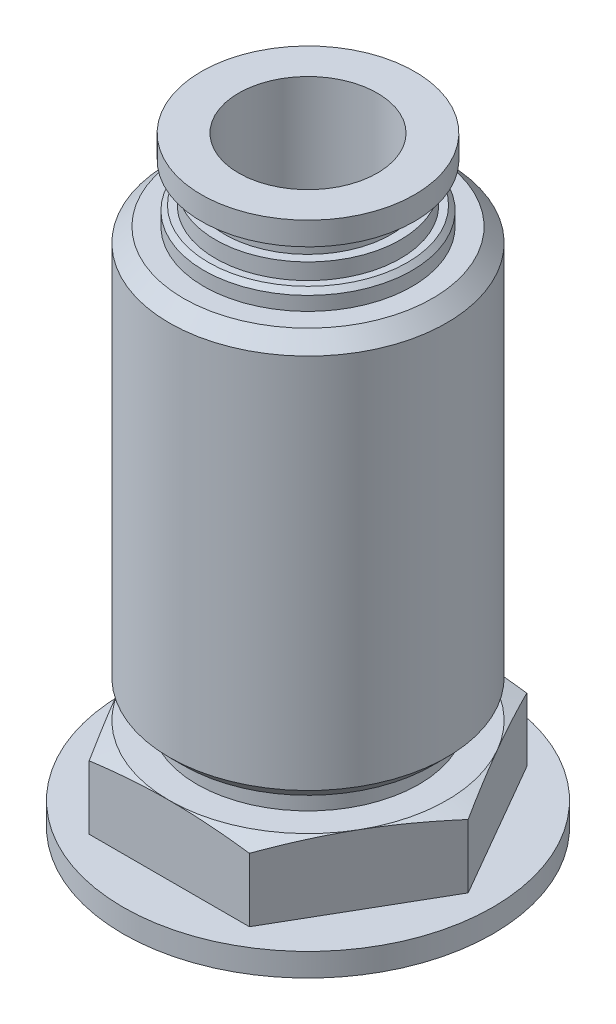
ISO-10303-21;
HEADER;
FILE_DESCRIPTION(('STEP AP214'),'2;1');
FILE_NAME('part.step','',(''),(''),'','','');
FILE_SCHEMA(('AUTOMOTIVE_DESIGN { 1 0 10303 214 1 1 1 1 }'));
ENDSEC;
DATA;
#1=APPLICATION_CONTEXT('core data for automotive mechanical design processes');
#2=APPLICATION_PROTOCOL_DEFINITION('international standard','automotive_design',2000,#1);
#3=PRODUCT_CONTEXT('',#1,'mechanical');
#4=PRODUCT('Part','Part','',(#3));
#5=PRODUCT_RELATED_PRODUCT_CATEGORY('part','',(#4));
#6=PRODUCT_DEFINITION_FORMATION('','',#4);
#7=PRODUCT_DEFINITION_CONTEXT('part definition',#1,'design');
#8=PRODUCT_DEFINITION('design','',#6,#7);
#9=PRODUCT_DEFINITION_SHAPE('','',#8);
#10=(LENGTH_UNIT() NAMED_UNIT(*) SI_UNIT(.MILLI.,.METRE.));
#11=(NAMED_UNIT(*) PLANE_ANGLE_UNIT() SI_UNIT($,.RADIAN.));
#12=(NAMED_UNIT(*) SI_UNIT($,.STERADIAN.) SOLID_ANGLE_UNIT());
#13=UNCERTAINTY_MEASURE_WITH_UNIT(LENGTH_MEASURE(1.E-05),#10,'distance_accuracy_value','');
#14=(GEOMETRIC_REPRESENTATION_CONTEXT(3) GLOBAL_UNCERTAINTY_ASSIGNED_CONTEXT((#13)) GLOBAL_UNIT_ASSIGNED_CONTEXT((#10,
#11,#12)) REPRESENTATION_CONTEXT('',''));
#15=CARTESIAN_POINT('',(0.,0.,0.));
#16=DIRECTION('',(0.,0.,1.));
#17=DIRECTION('',(1.,0.,0.));
#18=AXIS2_PLACEMENT_3D('',#15,#16,#17);
#19=CARTESIAN_POINT('',(5.3865,13.,0.));
#20=DIRECTION('',(0.,1.,0.));
#21=DIRECTION('',(0.,0.,1.));
#22=AXIS2_PLACEMENT_3D('',#19,#20,#21);
#23=PLANE('',#22);
#24=CARTESIAN_POINT('',(0.,13.,0.));
#25=DIRECTION('',(0.,1.,0.));
#26=DIRECTION('',(0.,0.,1.));
#27=AXIS2_PLACEMENT_3D('',#24,#25,#26);
#28=CIRCLE('',#27,5.3865);
#29=CARTESIAN_POINT('',(0.,13.,5.3865));
#30=VERTEX_POINT('',#29);
#31=EDGE_CURVE('E176',#30,#30,#28,.T.);
#32=ORIENTED_EDGE('',*,*,#31,.F.);
#33=EDGE_LOOP('',(#32));
#34=FACE_BOUND('',#33,.T.);
#35=CARTESIAN_POINT('',(0.,13.,0.));
#36=DIRECTION('',(0.,1.,0.));
#37=DIRECTION('',(0.,0.,1.));
#38=AXIS2_PLACEMENT_3D('',#35,#36,#37);
#39=CIRCLE('',#38,4.8);
#40=CARTESIAN_POINT('',(0.,13.,4.8));
#41=VERTEX_POINT('',#40);
#42=EDGE_CURVE('E11',#41,#41,#39,.F.);
#43=ORIENTED_EDGE('',*,*,#42,.F.);
#44=EDGE_LOOP('',(#43));
#45=FACE_BOUND('',#44,.T.);
#46=ADVANCED_FACE('F39',(#34,#45),#23,.F.);
#47=CARTESIAN_POINT('',(0.,34.,0.));
#48=DIRECTION('',(0.,-1.,0.));
#49=DIRECTION('',(1.,0.,0.));
#50=AXIS2_PLACEMENT_3D('',#47,#48,#49);
#51=PLANE('',#50);
#52=CARTESIAN_POINT('',(0.,34.,0.));
#53=DIRECTION('',(0.,1.,0.));
#54=DIRECTION('',(-1.,0.,0.));
#55=AXIS2_PLACEMENT_3D('',#52,#53,#54);
#56=CIRCLE('',#55,4.6153846153846);
#57=CARTESIAN_POINT('',(-4.6153846153846,34.,0.));
#58=VERTEX_POINT('',#57);
#59=EDGE_CURVE('E200',#58,#58,#56,.T.);
#60=ORIENTED_EDGE('',*,*,#59,.T.);
#61=EDGE_LOOP('',(#60));
#62=FACE_BOUND('',#61,.T.);
#63=CARTESIAN_POINT('',(0.,34.,0.));
#64=DIRECTION('',(0.,1.,0.));
#65=DIRECTION('',(0.,0.,1.));
#66=AXIS2_PLACEMENT_3D('',#63,#64,#65);
#67=CIRCLE('',#66,3.);
#68=CARTESIAN_POINT('',(0.,34.,3.));
#69=VERTEX_POINT('',#68);
#70=EDGE_CURVE('E133',#69,#69,#67,.T.);
#71=ORIENTED_EDGE('',*,*,#70,.F.);
#72=EDGE_LOOP('',(#71));
#73=FACE_BOUND('',#72,.T.);
#74=ADVANCED_FACE('F41',(#62,#73),#51,.F.);
#75=CARTESIAN_POINT('',(0.,30.5,0.));
#76=DIRECTION('',(0.,-1.,0.));
#77=DIRECTION('',(0.,0.,-1.));
#78=AXIS2_PLACEMENT_3D('',#75,#76,#77);
#79=PLANE('',#78);
#80=CARTESIAN_POINT('',(0.,30.5,0.));
#81=DIRECTION('',(0.,1.,0.));
#82=DIRECTION('',(0.,0.,1.));
#83=AXIS2_PLACEMENT_3D('',#80,#81,#82);
#84=CIRCLE('',#83,5.3865);
#85=CARTESIAN_POINT('',(0.,30.5,5.3865));
#86=VERTEX_POINT('',#85);
#87=EDGE_CURVE('E185',#86,#86,#84,.T.);
#88=ORIENTED_EDGE('',*,*,#87,.T.);
#89=EDGE_LOOP('',(#88));
#90=FACE_BOUND('',#89,.T.);
#91=CARTESIAN_POINT('',(0.,30.5,0.));
#92=DIRECTION('',(0.,-1.,0.));
#93=DIRECTION('',(0.,0.,-1.));
#94=AXIS2_PLACEMENT_3D('',#91,#92,#93);
#95=CIRCLE('',#94,4.5);
#96=CARTESIAN_POINT('',(0.,30.5,-4.5));
#97=VERTEX_POINT('',#96);
#98=EDGE_CURVE('E203',#97,#97,#95,.F.);
#99=ORIENTED_EDGE('',*,*,#98,.F.);
#100=EDGE_LOOP('',(#99));
#101=FACE_BOUND('',#100,.T.);
#102=ADVANCED_FACE('F279',(#90,#101),#79,.F.);
#103=CARTESIAN_POINT('',(0.,29.8865,0.));
#104=DIRECTION('',(0.,-1.,0.));
#105=DIRECTION('',(0.,0.,-1.));
#106=AXIS2_PLACEMENT_3D('',#103,#104,#105);
#107=CONICAL_SURFACE('',#106,6.,0.785398163397446);
#108=ORIENTED_EDGE('',*,*,#87,.F.);
#109=EDGE_LOOP('',(#108));
#110=FACE_BOUND('',#109,.T.);
#111=CARTESIAN_POINT('',(0.,29.8865,0.));
#112=DIRECTION('',(0.,1.,0.));
#113=DIRECTION('',(0.,0.,1.));
#114=AXIS2_PLACEMENT_3D('',#111,#112,#113);
#115=CIRCLE('',#114,6.);
#116=CARTESIAN_POINT('',(0.,29.8865,6.));
#117=VERTEX_POINT('',#116);
#118=EDGE_CURVE('E182',#117,#117,#115,.T.);
#119=ORIENTED_EDGE('',*,*,#118,.T.);
#120=EDGE_LOOP('',(#119));
#121=FACE_BOUND('',#120,.T.);
#122=ADVANCED_FACE('F294',(#110,#121),#107,.T.);
#123=CARTESIAN_POINT('',(0.,13.,0.));
#124=DIRECTION('',(0.,1.,0.));
#125=DIRECTION('',(0.,0.,1.));
#126=AXIS2_PLACEMENT_3D('',#123,#124,#125);
#127=CYLINDRICAL_SURFACE('',#126,6.);
#128=ORIENTED_EDGE('',*,*,#118,.F.);
#129=EDGE_LOOP('',(#128));
#130=FACE_BOUND('',#129,.T.);
#131=CARTESIAN_POINT('',(0.,13.6135,0.));
#132=DIRECTION('',(0.,1.,0.));
#133=DIRECTION('',(0.,0.,1.));
#134=AXIS2_PLACEMENT_3D('',#131,#132,#133);
#135=CIRCLE('',#134,6.);
#136=CARTESIAN_POINT('',(0.,13.6135,6.));
#137=VERTEX_POINT('',#136);
#138=EDGE_CURVE('E179',#137,#137,#135,.T.);
#139=ORIENTED_EDGE('',*,*,#138,.T.);
#140=EDGE_LOOP('',(#139));
#141=FACE_BOUND('',#140,.T.);
#142=ADVANCED_FACE('F290',(#130,#141),#127,.T.);
#143=CARTESIAN_POINT('',(0.,13.,0.));
#144=DIRECTION('',(0.,1.,0.));
#145=DIRECTION('',(0.,0.,1.));
#146=AXIS2_PLACEMENT_3D('',#143,#144,#145);
#147=CONICAL_SURFACE('',#146,5.3865,0.785398163397448);
#148=ORIENTED_EDGE('',*,*,#138,.F.);
#149=EDGE_LOOP('',(#148));
#150=FACE_BOUND('',#149,.T.);
#151=ORIENTED_EDGE('',*,*,#31,.T.);
#152=EDGE_LOOP('',(#151));
#153=FACE_BOUND('',#152,.T.);
#154=ADVANCED_FACE('F287',(#150,#153),#147,.T.);
#155=CARTESIAN_POINT('',(4.,31.3,0.));
#156=DIRECTION('',(0.,-1.,0.));
#157=DIRECTION('',(0.,0.,-1.));
#158=AXIS2_PLACEMENT_3D('',#155,#156,#157);
#159=PLANE('',#158);
#160=CARTESIAN_POINT('',(0.,31.3,0.));
#161=DIRECTION('',(0.,-1.,0.));
#162=DIRECTION('',(0.,0.,-1.));
#163=AXIS2_PLACEMENT_3D('',#160,#161,#162);
#164=CIRCLE('',#163,4.);
#165=CARTESIAN_POINT('',(0.,31.3,-4.));
#166=VERTEX_POINT('',#165);
#167=EDGE_CURVE('E206',#166,#166,#164,.T.);
#168=ORIENTED_EDGE('',*,*,#167,.T.);
#169=EDGE_LOOP('',(#168));
#170=FACE_BOUND('',#169,.T.);
#171=CARTESIAN_POINT('',(0.,31.3,0.));
#172=DIRECTION('',(0.,1.,0.));
#173=DIRECTION('',(0.,0.,1.));
#174=AXIS2_PLACEMENT_3D('',#171,#172,#173);
#175=CIRCLE('',#174,4.3);
#176=CARTESIAN_POINT('',(0.,31.3,4.3));
#177=VERTEX_POINT('',#176);
#178=EDGE_CURVE('E173',#177,#177,#175,.T.);
#179=ORIENTED_EDGE('',*,*,#178,.T.);
#180=EDGE_LOOP('',(#179));
#181=FACE_BOUND('',#180,.T.);
#182=ADVANCED_FACE('F285',(#170,#181),#159,.F.);
#183=CARTESIAN_POINT('',(0.,31.1,0.));
#184=DIRECTION('',(0.,-1.,0.));
#185=DIRECTION('',(0.,0.,-1.));
#186=AXIS2_PLACEMENT_3D('',#183,#184,#185);
#187=CONICAL_SURFACE('',#186,4.5,0.785398163397442);
#188=ORIENTED_EDGE('',*,*,#178,.F.);
#189=EDGE_LOOP('',(#188));
#190=FACE_BOUND('',#189,.T.);
#191=CARTESIAN_POINT('',(0.,31.1,0.));
#192=DIRECTION('',(0.,1.,0.));
#193=DIRECTION('',(0.,0.,1.));
#194=AXIS2_PLACEMENT_3D('',#191,#192,#193);
#195=CIRCLE('',#194,4.5);
#196=CARTESIAN_POINT('',(0.,31.1,4.5));
#197=VERTEX_POINT('',#196);
#198=EDGE_CURVE('E169',#197,#197,#195,.T.);
#199=ORIENTED_EDGE('',*,*,#198,.T.);
#200=EDGE_LOOP('',(#199));
#201=FACE_BOUND('',#200,.T.);
#202=ADVANCED_FACE('F509',(#190,#201),#187,.T.);
#203=CARTESIAN_POINT('',(0.,30.5,0.));
#204=DIRECTION('',(0.,1.,0.));
#205=DIRECTION('',(0.,0.,1.));
#206=AXIS2_PLACEMENT_3D('',#203,#204,#205);
#207=CYLINDRICAL_SURFACE('',#206,4.5);
#208=ORIENTED_EDGE('',*,*,#198,.F.);
#209=EDGE_LOOP('',(#208));
#210=FACE_BOUND('',#209,.T.);
#211=ORIENTED_EDGE('',*,*,#98,.T.);
#212=EDGE_LOOP('',(#211));
#213=FACE_BOUND('',#212,.T.);
#214=ADVANCED_FACE('F423',(#210,#213),#207,.T.);
#215=CARTESIAN_POINT('',(0.,8.,0.));
#216=DIRECTION('',(0.,1.,0.));
#217=DIRECTION('',(-1.,0.,0.));
#218=AXIS2_PLACEMENT_3D('',#215,#216,#217);
#219=CYLINDRICAL_SURFACE('',#218,4.6153846153846);
#220=ORIENTED_EDGE('',*,*,#59,.F.);
#221=EDGE_LOOP('',(#220));
#222=FACE_BOUND('',#221,.T.);
#223=CARTESIAN_POINT('',(0.,33.,0.));
#224=DIRECTION('',(0.,1.,0.));
#225=DIRECTION('',(-1.,0.,0.));
#226=AXIS2_PLACEMENT_3D('',#223,#224,#225);
#227=CIRCLE('',#226,4.6153846153846);
#228=CARTESIAN_POINT('',(-4.6153846153846,33.,0.));
#229=VERTEX_POINT('',#228);
#230=EDGE_CURVE('E197',#229,#229,#227,.T.);
#231=ORIENTED_EDGE('',*,*,#230,.T.);
#232=EDGE_LOOP('',(#231));
#233=FACE_BOUND('',#232,.T.);
#234=ADVANCED_FACE('F518',(#222,#233),#219,.T.);
#235=CARTESIAN_POINT('',(4.6153846153846,33.,0.));
#236=DIRECTION('',(0.,1.,0.));
#237=DIRECTION('',(-1.,0.,0.));
#238=AXIS2_PLACEMENT_3D('',#235,#236,#237);
#239=PLANE('',#238);
#240=ORIENTED_EDGE('',*,*,#230,.F.);
#241=EDGE_LOOP('',(#240));
#242=FACE_BOUND('',#241,.T.);
#243=CARTESIAN_POINT('',(0.,33.,0.));
#244=DIRECTION('',(0.,1.,0.));
#245=DIRECTION('',(-1.,0.,0.));
#246=AXIS2_PLACEMENT_3D('',#243,#244,#245);
#247=CIRCLE('',#246,3.6);
#248=CARTESIAN_POINT('',(-3.6,33.,0.));
#249=VERTEX_POINT('',#248);
#250=EDGE_CURVE('E194',#249,#249,#247,.T.);
#251=ORIENTED_EDGE('',*,*,#250,.T.);
#252=EDGE_LOOP('',(#251));
#253=FACE_BOUND('',#252,.T.);
#254=ADVANCED_FACE('F521',(#242,#253),#239,.F.);
#255=CARTESIAN_POINT('',(0.,8.,0.));
#256=DIRECTION('',(0.,1.,0.));
#257=DIRECTION('',(-1.,0.,0.));
#258=AXIS2_PLACEMENT_3D('',#255,#256,#257);
#259=CYLINDRICAL_SURFACE('',#258,3.6);
#260=ORIENTED_EDGE('',*,*,#250,.F.);
#261=EDGE_LOOP('',(#260));
#262=FACE_BOUND('',#261,.T.);
#263=CARTESIAN_POINT('',(0.,32.,0.));
#264=DIRECTION('',(0.,1.,0.));
#265=DIRECTION('',(-1.,0.,0.));
#266=AXIS2_PLACEMENT_3D('',#263,#264,#265);
#267=CIRCLE('',#266,3.6);
#268=CARTESIAN_POINT('',(-3.6,32.,0.));
#269=VERTEX_POINT('',#268);
#270=EDGE_CURVE('E191',#269,#269,#267,.T.);
#271=ORIENTED_EDGE('',*,*,#270,.T.);
#272=EDGE_LOOP('',(#271));
#273=FACE_BOUND('',#272,.T.);
#274=ADVANCED_FACE('F531',(#262,#273),#259,.T.);
#275=CARTESIAN_POINT('',(3.6,32.,0.));
#276=DIRECTION('',(0.,-1.,0.));
#277=DIRECTION('',(1.,0.,0.));
#278=AXIS2_PLACEMENT_3D('',#275,#276,#277);
#279=PLANE('',#278);
#280=ORIENTED_EDGE('',*,*,#270,.F.);
#281=EDGE_LOOP('',(#280));
#282=FACE_BOUND('',#281,.T.);
#283=CARTESIAN_POINT('',(0.,32.,0.));
#284=DIRECTION('',(0.,1.,0.));
#285=DIRECTION('',(-1.,0.,0.));
#286=AXIS2_PLACEMENT_3D('',#283,#284,#285);
#287=CIRCLE('',#286,4.);
#288=CARTESIAN_POINT('',(-4.,32.,0.));
#289=VERTEX_POINT('',#288);
#290=EDGE_CURVE('E188',#289,#289,#287,.T.);
#291=ORIENTED_EDGE('',*,*,#290,.T.);
#292=EDGE_LOOP('',(#291));
#293=FACE_BOUND('',#292,.T.);
#294=ADVANCED_FACE('F480',(#282,#293),#279,.F.);
#295=CARTESIAN_POINT('',(0.,8.,0.));
#296=DIRECTION('',(0.,1.,0.));
#297=DIRECTION('',(-1.,0.,0.));
#298=AXIS2_PLACEMENT_3D('',#295,#296,#297);
#299=CYLINDRICAL_SURFACE('',#298,4.);
#300=ORIENTED_EDGE('',*,*,#290,.F.);
#301=EDGE_LOOP('',(#300));
#302=FACE_BOUND('',#301,.T.);
#303=ORIENTED_EDGE('',*,*,#167,.F.);
#304=EDGE_LOOP('',(#303));
#305=FACE_BOUND('',#304,.T.);
#306=ADVANCED_FACE('F321',(#302,#305),#299,.T.);
#307=CARTESIAN_POINT('',(0.,22.3,0.));
#308=DIRECTION('',(0.,1.,0.));
#309=DIRECTION('',(0.,0.,1.));
#310=AXIS2_PLACEMENT_3D('',#307,#308,#309);
#311=CYLINDRICAL_SURFACE('',#310,3.);
#312=ORIENTED_EDGE('',*,*,#70,.T.);
#313=EDGE_LOOP('',(#312));
#314=FACE_BOUND('',#313,.T.);
#315=CARTESIAN_POINT('',(0.,22.3,0.));
#316=DIRECTION('',(0.,1.,0.));
#317=DIRECTION('',(0.,0.,1.));
#318=AXIS2_PLACEMENT_3D('',#315,#316,#317);
#319=CIRCLE('',#318,3.);
#320=CARTESIAN_POINT('',(0.,22.3,3.));
#321=VERTEX_POINT('',#320);
#322=EDGE_CURVE('E136',#321,#321,#319,.T.);
#323=ORIENTED_EDGE('',*,*,#322,.F.);
#324=EDGE_LOOP('',(#323));
#325=FACE_BOUND('',#324,.T.);
#326=ADVANCED_FACE('F316',(#314,#325),#311,.F.);
#327=CARTESIAN_POINT('',(3.,22.3,0.));
#328=DIRECTION('',(0.,1.,0.));
#329=DIRECTION('',(0.,0.,1.));
#330=AXIS2_PLACEMENT_3D('',#327,#328,#329);
#331=PLANE('',#330);
#332=ORIENTED_EDGE('',*,*,#322,.T.);
#333=EDGE_LOOP('',(#332));
#334=FACE_BOUND('',#333,.T.);
#335=ADVANCED_FACE('F309',(#334),#331,.T.);
#336=CARTESIAN_POINT('',(0.,12.,0.));
#337=DIRECTION('',(0.,1.,0.));
#338=DIRECTION('',(0.,0.,1.));
#339=AXIS2_PLACEMENT_3D('',#336,#337,#338);
#340=CYLINDRICAL_SURFACE('',#339,4.8);
#341=ORIENTED_EDGE('',*,*,#42,.T.);
#342=EDGE_LOOP('',(#341));
#343=FACE_BOUND('',#342,.T.);
#344=CARTESIAN_POINT('',(0.,12.,0.));
#345=DIRECTION('',(0.,-1.,0.));
#346=DIRECTION('',(1.,0.,0.));
#347=AXIS2_PLACEMENT_3D('',#344,#345,#346);
#348=CIRCLE('',#347,4.8);
#349=CARTESIAN_POINT('',(4.8,12.,0.));
#350=VERTEX_POINT('',#349);
#351=EDGE_CURVE('E47',#350,#350,#348,.F.);
#352=ORIENTED_EDGE('',*,*,#351,.T.);
#353=EDGE_LOOP('',(#352));
#354=FACE_BOUND('',#353,.T.);
#355=ADVANCED_FACE('F256',(#343,#354),#340,.T.);
#356=CARTESIAN_POINT('',(3.1578947368421,8.,0.));
#357=DIRECTION('',(0.,1.,0.));
#358=DIRECTION('',(-1.,0.,0.));
#359=AXIS2_PLACEMENT_3D('',#356,#357,#358);
#360=PLANE('',#359);
#361=CARTESIAN_POINT('',(0.,8.,0.));
#362=DIRECTION('',(0.,1.,0.));
#363=DIRECTION('',(0.,0.,1.));
#364=AXIS2_PLACEMENT_3D('',#361,#362,#363);
#365=CIRCLE('',#364,8.);
#366=CARTESIAN_POINT('',(0.,8.,8.));
#367=VERTEX_POINT('',#366);
#368=EDGE_CURVE('E149',#367,#367,#365,.T.);
#369=ORIENTED_EDGE('',*,*,#368,.F.);
#370=EDGE_LOOP('',(#369));
#371=FACE_BOUND('',#370,.T.);
#372=ADVANCED_FACE('F301',(#371),#360,.F.);
#373=CARTESIAN_POINT('',(0.,8.,0.));
#374=DIRECTION('',(0.,1.,0.));
#375=DIRECTION('',(0.,0.,1.));
#376=AXIS2_PLACEMENT_3D('',#373,#374,#375);
#377=CYLINDRICAL_SURFACE('',#376,8.);
#378=CARTESIAN_POINT('',(0.,9.,0.));
#379=DIRECTION('',(0.,1.,0.));
#380=DIRECTION('',(0.,0.,1.));
#381=AXIS2_PLACEMENT_3D('',#378,#379,#380);
#382=CIRCLE('',#381,8.);
#383=CARTESIAN_POINT('',(0.,9.,8.));
#384=VERTEX_POINT('',#383);
#385=EDGE_CURVE('E162',#384,#384,#382,.T.);
#386=ORIENTED_EDGE('',*,*,#385,.F.);
#387=EDGE_LOOP('',(#386));
#388=FACE_BOUND('',#387,.T.);
#389=ORIENTED_EDGE('',*,*,#368,.T.);
#390=EDGE_LOOP('',(#389));
#391=FACE_BOUND('',#390,.T.);
#392=ADVANCED_FACE('F237',(#388,#391),#377,.T.);
#393=CARTESIAN_POINT('',(7.2,9.,0.));
#394=DIRECTION('',(0.,-1.,0.));
#395=DIRECTION('',(0.,0.,-1.));
#396=AXIS2_PLACEMENT_3D('',#393,#394,#395);
#397=PLANE('',#396);
#398=ORIENTED_EDGE('',*,*,#385,.T.);
#399=EDGE_LOOP('',(#398));
#400=FACE_BOUND('',#399,.T.);
#401=DIRECTION('',(-1.,0.,0.));
#402=VECTOR('',#401,1.);
#403=CARTESIAN_POINT('',(3.4641016151378,9.,-6.));
#404=LINE('',#403,#402);
#405=CARTESIAN_POINT('',(3.4641016151378,9.,-6.));
#406=VERTEX_POINT('',#405);
#407=CARTESIAN_POINT('',(-3.4641016151378,9.,-6.));
#408=VERTEX_POINT('',#407);
#409=EDGE_CURVE('E117',#406,#408,#404,.T.);
#410=ORIENTED_EDGE('',*,*,#409,.F.);
#411=DIRECTION('',(-0.499999999999994,0.,-0.866025403784442));
#412=VECTOR('',#411,1.);
#413=CARTESIAN_POINT('',(6.9282032302755,9.,0.));
#414=LINE('',#413,#412);
#415=CARTESIAN_POINT('',(6.9282032302755,9.,0.));
#416=VERTEX_POINT('',#415);
#417=EDGE_CURVE('E144',#416,#406,#414,.T.);
#418=ORIENTED_EDGE('',*,*,#417,.F.);
#419=DIRECTION('',(0.499999999999994,0.,-0.866025403784442));
#420=VECTOR('',#419,1.);
#421=CARTESIAN_POINT('',(3.4641016151378,9.,6.));
#422=LINE('',#421,#420);
#423=CARTESIAN_POINT('',(3.4641016151378,9.,6.));
#424=VERTEX_POINT('',#423);
#425=EDGE_CURVE('E141',#424,#416,#422,.T.);
#426=ORIENTED_EDGE('',*,*,#425,.F.);
#427=DIRECTION('',(1.,0.,0.));
#428=VECTOR('',#427,1.);
#429=CARTESIAN_POINT('',(-3.4641016151378,9.,6.));
#430=LINE('',#429,#428);
#431=CARTESIAN_POINT('',(-3.4641016151378,9.,6.));
#432=VERTEX_POINT('',#431);
#433=EDGE_CURVE('E127',#432,#424,#430,.T.);
#434=ORIENTED_EDGE('',*,*,#433,.F.);
#435=DIRECTION('',(0.499999999999994,0.,0.866025403784442));
#436=VECTOR('',#435,1.);
#437=CARTESIAN_POINT('',(-6.9282032302755,9.,0.));
#438=LINE('',#437,#436);
#439=CARTESIAN_POINT('',(-6.9282032302755,9.,0.));
#440=VERTEX_POINT('',#439);
#441=EDGE_CURVE('E113',#440,#432,#438,.T.);
#442=ORIENTED_EDGE('',*,*,#441,.F.);
#443=DIRECTION('',(-0.499999999999994,0.,0.866025403784442));
#444=VECTOR('',#443,1.);
#445=CARTESIAN_POINT('',(-3.4641016151378,9.,-6.));
#446=LINE('',#445,#444);
#447=EDGE_CURVE('E123',#408,#440,#446,.T.);
#448=ORIENTED_EDGE('',*,*,#447,.F.);
#449=EDGE_LOOP('',(#410,#418,#426,#434,#442,#448));
#450=FACE_BOUND('',#449,.T.);
#451=ADVANCED_FACE('F122',(#400,#450),#397,.F.);
#452=CARTESIAN_POINT('',(-6.9282032302755,9.,0.));
#453=DIRECTION('',(-0.866025403784442,0.,0.499999999999994));
#454=DIRECTION('',(0.499999999999994,0.,0.866025403784442));
#455=AXIS2_PLACEMENT_3D('',#452,#453,#454);
#456=PLANE('',#455);
#457=CARTESIAN_POINT('',(-3.46398614508396,11.7512577531548,6.0002));
#458=CARTESIAN_POINT('',(-3.60785114953801,11.7898227766866,5.75101850285446));
#459=CARTESIAN_POINT('',(-3.75197700039371,11.8248334749827,5.5013852064883));
#460=CARTESIAN_POINT('',(-4.04073770144574,11.8863440142673,5.00123700103696));
#461=CARTESIAN_POINT('',(-4.1853727343495,11.9128403981973,4.75072177549324));
#462=CARTESIAN_POINT('',(-4.47427486270241,11.9557754458708,4.25032861077121));
#463=CARTESIAN_POINT('',(-4.6185400045307,11.9722653122634,4.00045405536348));
#464=CARTESIAN_POINT('',(-4.90725426581544,11.9943765378923,3.5003862859486));
#465=CARTESIAN_POINT('',(-5.05170334426104,12.,3.2501931429743));
#466=CARTESIAN_POINT('',(-5.34060150115226,12.,2.7498068570257));
#467=CARTESIAN_POINT('',(-5.48505057959786,11.9943765378923,2.49961371405141));
#468=CARTESIAN_POINT('',(-5.7737648408826,11.9722653122634,1.99954594463652));
#469=CARTESIAN_POINT('',(-5.91802998271089,11.9557754458708,1.74967138922879));
#470=CARTESIAN_POINT('',(-6.2069321110638,11.9128403981974,1.24927822450676));
#471=CARTESIAN_POINT('',(-6.35156714396756,11.8863440142673,0.998762998963044));
#472=CARTESIAN_POINT('',(-6.64032784501959,11.8248334749827,0.498614793511703));
#473=CARTESIAN_POINT('',(-6.78445369587529,11.7898227766866,0.248981497145543));
#474=CARTESIAN_POINT('',(-6.92831870032934,11.7512577531548,-0.00020000000000002));
#475=B_SPLINE_CURVE_WITH_KNOTS('',3,(#457,#458,#459,#460,#461,#462,#463,#464,#465,#466,#467,
#468,#469,#470,#471,#472,#473,#474),.UNSPECIFIED.,.F.,.F.,(4,2,2,2,2,2,2,2,4),(0.,
0.87095456724898,1.74226232176158,2.60907321145345,3.47571633871004,4.34235946596663,
5.20917035565849,6.0804781101711,6.95143267742008),.UNSPECIFIED.);
#476=CARTESIAN_POINT('',(-3.4641016151378,11.751288694036,6.));
#477=VERTEX_POINT('',#476);
#478=CARTESIAN_POINT('',(-5.19615242270667,12.,2.99999999999997));
#479=VERTEX_POINT('',#478);
#480=EDGE_CURVE('E54',#477,#479,#475,.T.);
#481=ORIENTED_EDGE('',*,*,#480,.T.);
#482=CARTESIAN_POINT('',(-6.9282032302755,11.751288694036,0.));
#483=VERTEX_POINT('',#482);
#484=EDGE_CURVE('E114',#479,#483,#475,.T.);
#485=ORIENTED_EDGE('',*,*,#484,.T.);
#486=DIRECTION('',(0.,1.,0.));
#487=VECTOR('',#486,1.);
#488=CARTESIAN_POINT('',(-6.9282032302755,9.,0.));
#489=LINE('',#488,#487);
#490=EDGE_CURVE('E110',#440,#483,#489,.T.);
#491=ORIENTED_EDGE('',*,*,#490,.F.);
#492=ORIENTED_EDGE('',*,*,#441,.T.);
#493=DIRECTION('',(0.,1.,0.));
#494=VECTOR('',#493,1.);
#495=CARTESIAN_POINT('',(-3.4641016151378,9.,6.));
#496=LINE('',#495,#494);
#497=EDGE_CURVE('E116',#432,#477,#496,.T.);
#498=ORIENTED_EDGE('',*,*,#497,.T.);
#499=EDGE_LOOP('',(#481,#485,#491,#492,#498));
#500=FACE_BOUND('',#499,.T.);
#501=ADVANCED_FACE('F112',(#500),#456,.T.);
#502=CARTESIAN_POINT('',(-3.4641016151378,9.,-6.));
#503=DIRECTION('',(-0.866025403784442,0.,-0.499999999999994));
#504=DIRECTION('',(-0.499999999999994,0.,0.866025403784442));
#505=AXIS2_PLACEMENT_3D('',#502,#503,#504);
#506=PLANE('',#505);
#507=CARTESIAN_POINT('',(-6.92831870032934,11.7512577531548,0.000200000000000273));
#508=CARTESIAN_POINT('',(-6.78445369587529,11.7898227766866,-0.248981497145544));
#509=CARTESIAN_POINT('',(-6.64032784501959,11.8248334749827,-0.498614793511703));
#510=CARTESIAN_POINT('',(-6.35156714396756,11.8863440142673,-0.998762998963043));
#511=CARTESIAN_POINT('',(-6.2069321110638,11.9128403981974,-1.24927822450676));
#512=CARTESIAN_POINT('',(-5.91802998271089,11.9557754458708,-1.74967138922879));
#513=CARTESIAN_POINT('',(-5.7737648408826,11.9722653122634,-1.99954594463652));
#514=CARTESIAN_POINT('',(-5.48505057959786,11.9943765378923,-2.49961371405141));
#515=CARTESIAN_POINT('',(-5.34060150115226,12.,-2.7498068570257));
#516=CARTESIAN_POINT('',(-5.05170334426104,12.,-3.2501931429743));
#517=CARTESIAN_POINT('',(-4.90725426581544,11.9943765378923,-3.5003862859486));
#518=CARTESIAN_POINT('',(-4.6185400045307,11.9722653122634,-4.00045405536348));
#519=CARTESIAN_POINT('',(-4.47427486270241,11.9557754458708,-4.25032861077121));
#520=CARTESIAN_POINT('',(-4.1853727343495,11.9128403981973,-4.75072177549324));
#521=CARTESIAN_POINT('',(-4.04073770144574,11.8863440142673,-5.00123700103696));
#522=CARTESIAN_POINT('',(-3.75197700039371,11.8248334749827,-5.5013852064883));
#523=CARTESIAN_POINT('',(-3.60785114953801,11.7898227766866,-5.75101850285446));
#524=CARTESIAN_POINT('',(-3.46398614508396,11.7512577531548,-6.0002));
#525=B_SPLINE_CURVE_WITH_KNOTS('',3,(#507,#508,#509,#510,#511,#512,#513,#514,#515,#516,#517,
#518,#519,#520,#521,#522,#523,#524),.UNSPECIFIED.,.F.,.F.,(4,2,2,2,2,2,2,2,4),(0.,
0.870954567248979,1.74226232176158,2.60907321145345,3.47571633871004,4.34235946596663,
5.20917035565849,6.08047811017109,6.95143267742008),.UNSPECIFIED.);
#526=CARTESIAN_POINT('',(-5.19615242270667,12.,-2.99999999999997));
#527=VERTEX_POINT('',#526);
#528=EDGE_CURVE('E62',#483,#527,#525,.T.);
#529=ORIENTED_EDGE('',*,*,#528,.T.);
#530=CARTESIAN_POINT('',(-3.4641016151378,11.751288694036,-6.));
#531=VERTEX_POINT('',#530);
#532=EDGE_CURVE('E239',#527,#531,#525,.T.);
#533=ORIENTED_EDGE('',*,*,#532,.T.);
#534=DIRECTION('',(0.,1.,0.));
#535=VECTOR('',#534,1.);
#536=CARTESIAN_POINT('',(-3.4641016151378,9.,-6.));
#537=LINE('',#536,#535);
#538=EDGE_CURVE('E132',#408,#531,#537,.T.);
#539=ORIENTED_EDGE('',*,*,#538,.F.);
#540=ORIENTED_EDGE('',*,*,#447,.T.);
#541=ORIENTED_EDGE('',*,*,#490,.T.);
#542=EDGE_LOOP('',(#529,#533,#539,#540,#541));
#543=FACE_BOUND('',#542,.T.);
#544=ADVANCED_FACE('F130',(#543),#506,.T.);
#545=CARTESIAN_POINT('',(3.4641016151378,9.,-6.));
#546=DIRECTION('',(0.,0.,-1.));
#547=DIRECTION('',(-1.,0.,0.));
#548=AXIS2_PLACEMENT_3D('',#545,#546,#547);
#549=PLANE('',#548);
#550=CARTESIAN_POINT('',(-9.16382765485783,10.6727555670348,-6.));
#551=CARTESIAN_POINT('',(-8.89162489863269,10.733759588259,-6.));
#552=CARTESIAN_POINT('',(-8.61925188813901,10.7940175275095,-6.));
#553=CARTESIAN_POINT('',(-8.07408174438072,10.9126385252989,-6.));
#554=CARTESIAN_POINT('',(-7.80128459333043,10.9710015019998,-6.));
#555=CARTESIAN_POINT('',(-7.25493818445117,11.0854806473668,-6.));
#556=CARTESIAN_POINT('',(-6.98138845134595,11.1415945558695,-6.));
#557=CARTESIAN_POINT('',(-6.43371961760336,11.2509698760187,-6.));
#558=CARTESIAN_POINT('',(-6.15960052179164,11.3042313117397,-6.));
#559=CARTESIAN_POINT('',(-5.61288009287953,11.4068119519654,-6.));
#560=CARTESIAN_POINT('',(-5.34028403864809,11.4561591528044,-6.));
#561=CARTESIAN_POINT('',(-4.7943483713761,11.5505453002354,-6.));
#562=CARTESIAN_POINT('',(-4.52100877483286,11.5955843416254,-6.));
#563=CARTESIAN_POINT('',(-3.97353296098104,11.6803400730214,-6.));
#564=CARTESIAN_POINT('',(-3.69939684599487,11.7200574182413,-6.));
#565=CARTESIAN_POINT('',(-3.15025226081739,11.7929993521357,-6.));
#566=CARTESIAN_POINT('',(-2.87524378980905,11.8262239347275,-6.));
#567=CARTESIAN_POINT('',(-2.32125188635544,11.8852395423477,-6.));
#568=CARTESIAN_POINT('',(-2.0422588391531,11.9109416510582,-6.));
#569=CARTESIAN_POINT('',(-1.48357135195331,11.9531392361281,-6.));
#570=CARTESIAN_POINT('',(-1.20387692818903,11.9696349236277,-6.));
#571=CARTESIAN_POINT('',(-0.644192410317616,11.9924575712443,-6.));
#572=CARTESIAN_POINT('',(-0.36420250851933,11.998789152412,-6.));
#573=CARTESIAN_POINT('',(0.195817560334687,12.0008943092124,-6.));
#574=CARTESIAN_POINT('',(0.4758477273555,11.9966678939464,-6.));
#575=CARTESIAN_POINT('',(1.03657385560212,11.9778947367831,-6.));
#576=CARTESIAN_POINT('',(1.31726853715422,11.9633105383406,-6.));
#577=CARTESIAN_POINT('',(1.87799777180817,11.9246543031433,-6.));
#578=CARTESIAN_POINT('',(2.15803231015705,11.9005820563328,-6.));
#579=CARTESIAN_POINT('',(2.71743890307923,11.8441656885802,-6.));
#580=CARTESIAN_POINT('',(2.99681040476791,11.81181616937,-6.));
#581=CARTESIAN_POINT('',(3.55465431831763,11.7401913404367,-6.));
#582=CARTESIAN_POINT('',(3.83312672735307,11.7009160089691,-6.));
#583=CARTESIAN_POINT('',(4.37079108357547,11.6194842772285,-6.));
#584=CARTESIAN_POINT('',(4.63003857626493,11.5776909241219,-6.));
#585=CARTESIAN_POINT('',(5.14785025731751,11.4900474584768,-6.));
#586=CARTESIAN_POINT('',(5.40641442683975,11.444197235258,-6.));
#587=CARTESIAN_POINT('',(5.92295406743762,11.3491822400412,-6.));
#588=CARTESIAN_POINT('',(6.18092948361034,11.3000171710125,-6.));
#589=CARTESIAN_POINT('',(6.69635047199391,11.1989776154861,-6.));
#590=CARTESIAN_POINT('',(6.95379603729497,11.1471030938841,-6.));
#591=CARTESIAN_POINT('',(7.72556579429413,10.9881514393349,-6.));
#592=CARTESIAN_POINT('',(8.23920828092254,10.8777678111909,-6.));
#593=CARTESIAN_POINT('',(9.26512727645668,10.6510249493938,-6.));
#594=CARTESIAN_POINT('',(9.77740386342661,10.5346660652892,-6.));
#595=CARTESIAN_POINT('',(10.795950885197,10.2989027885365,-6.));
#596=CARTESIAN_POINT('',(11.3022308741471,10.179539557974,-6.));
#597=CARTESIAN_POINT('',(12.3140845458194,9.9378247836334,-6.));
#598=CARTESIAN_POINT('',(12.8196582154967,9.81547318541511,-6.));
#599=CARTESIAN_POINT('',(13.8296414737607,9.56871438982767,-6.));
#600=CARTESIAN_POINT('',(14.3340517289558,9.44430991544821,-6.));
#601=CARTESIAN_POINT('',(15.342432866452,9.19380225109001,-6.));
#602=CARTESIAN_POINT('',(15.8464037627037,9.06769911730612,-6.));
#603=CARTESIAN_POINT('',(16.3502215277059,8.94099441628253,-6.));
#604=B_SPLINE_CURVE_WITH_KNOTS('',3,(#550,#551,#552,#553,#554,#555,#556,#557,#558,#559,#560,
#561,#562,#563,#564,#565,#566,#567,#568,#569,#570,#571,#572,#573,#574,#575,#576,#577,#578,#579,
#580,#581,#582,#583,#584,#585,#586,#587,#588,#589,#590,#591,#592,#593,#594,#595,#596,#597,#598,
#599,#600,#601,#602,#603),.UNSPECIFIED.,.F.,.F.,(4,2,2,2,2,2,2,2,2,2,2,2,2,2,2,2,2,2,2,2,2,2,2,
2,2,2,4),(0.,0.836868078359521,1.67377225067133,2.51149738287136,3.34921544366766,
4.18026773125687,5.01130172790701,5.84223331240184,6.67316567535613,7.51355604767867,
8.35392714568046,9.19391606561573,10.0339042614476,10.8769456513052,11.7200057062844,
12.5636169955068,13.407230933402,14.194976895706,14.9827443560883,15.770582499348,
16.5584308525189,18.1344778451384,19.7104327448356,21.2709015916152,22.8313988872358,
24.3899704837216,25.9484906457265),.UNSPECIFIED.);
#605=CARTESIAN_POINT('',(0.,12.,-6.));
#606=VERTEX_POINT('',#605);
#607=EDGE_CURVE('E245',#531,#606,#604,.T.);
#608=ORIENTED_EDGE('',*,*,#607,.T.);
#609=CARTESIAN_POINT('',(3.4641016151378,11.751288694036,-6.));
#610=VERTEX_POINT('',#609);
#611=EDGE_CURVE('E246',#606,#610,#604,.T.);
#612=ORIENTED_EDGE('',*,*,#611,.T.);
#613=DIRECTION('',(0.,1.,0.));
#614=VECTOR('',#613,1.);
#615=CARTESIAN_POINT('',(3.4641016151378,9.,-6.));
#616=LINE('',#615,#614);
#617=EDGE_CURVE('E150',#406,#610,#616,.T.);
#618=ORIENTED_EDGE('',*,*,#617,.F.);
#619=ORIENTED_EDGE('',*,*,#409,.T.);
#620=ORIENTED_EDGE('',*,*,#538,.T.);
#621=EDGE_LOOP('',(#608,#612,#618,#619,#620));
#622=FACE_BOUND('',#621,.T.);
#623=ADVANCED_FACE('F236',(#622),#549,.T.);
#624=CARTESIAN_POINT('',(6.9282032302755,9.,0.));
#625=DIRECTION('',(0.866025403784442,0.,-0.499999999999994));
#626=DIRECTION('',(-0.499999999999994,0.,-0.866025403784442));
#627=AXIS2_PLACEMENT_3D('',#624,#625,#626);
#628=PLANE('',#627);
#629=CARTESIAN_POINT('',(3.46398614508396,11.7512577531548,-6.0002));
#630=CARTESIAN_POINT('',(3.60785114953801,11.7898227766866,-5.75101850285446));
#631=CARTESIAN_POINT('',(3.75197700039371,11.8248334749827,-5.5013852064883));
#632=CARTESIAN_POINT('',(4.04073770144574,11.8863440142673,-5.00123700103696));
#633=CARTESIAN_POINT('',(4.1853727343495,11.9128403981973,-4.75072177549324));
#634=CARTESIAN_POINT('',(4.47427486270241,11.9557754458708,-4.25032861077121));
#635=CARTESIAN_POINT('',(4.6185400045307,11.9722653122634,-4.00045405536348));
#636=CARTESIAN_POINT('',(4.90725426581544,11.9943765378923,-3.5003862859486));
#637=CARTESIAN_POINT('',(5.05170334426104,12.,-3.2501931429743));
#638=CARTESIAN_POINT('',(5.34060150115226,12.,-2.7498068570257));
#639=CARTESIAN_POINT('',(5.48505057959786,11.9943765378923,-2.49961371405141));
#640=CARTESIAN_POINT('',(5.7737648408826,11.9722653122634,-1.99954594463652));
#641=CARTESIAN_POINT('',(5.91802998271089,11.9557754458708,-1.74967138922879));
#642=CARTESIAN_POINT('',(6.2069321110638,11.9128403981974,-1.24927822450676));
#643=CARTESIAN_POINT('',(6.35156714396756,11.8863440142673,-0.998762998963044));
#644=CARTESIAN_POINT('',(6.64032784501959,11.8248334749827,-0.498614793511703));
#645=CARTESIAN_POINT('',(6.78445369587529,11.7898227766866,-0.248981497145543));
#646=CARTESIAN_POINT('',(6.92831870032934,11.7512577531548,0.00020000000000002));
#647=B_SPLINE_CURVE_WITH_KNOTS('',3,(#629,#630,#631,#632,#633,#634,#635,#636,#637,#638,#639,
#640,#641,#642,#643,#644,#645,#646),.UNSPECIFIED.,.F.,.F.,(4,2,2,2,2,2,2,2,4),(0.,
0.87095456724898,1.74226232176158,2.60907321145345,3.47571633871004,4.34235946596663,
5.20917035565849,6.0804781101711,6.95143267742008),.UNSPECIFIED.);
#648=CARTESIAN_POINT('',(5.19615242270667,12.,-2.99999999999997));
#649=VERTEX_POINT('',#648);
#650=EDGE_CURVE('E338',#610,#649,#647,.T.);
#651=ORIENTED_EDGE('',*,*,#650,.T.);
#652=CARTESIAN_POINT('',(6.9282032302755,11.751288694036,0.));
#653=VERTEX_POINT('',#652);
#654=EDGE_CURVE('E333',#649,#653,#647,.T.);
#655=ORIENTED_EDGE('',*,*,#654,.T.);
#656=DIRECTION('',(0.,1.,0.));
#657=VECTOR('',#656,1.);
#658=CARTESIAN_POINT('',(6.9282032302755,9.,0.));
#659=LINE('',#658,#657);
#660=EDGE_CURVE('E153',#416,#653,#659,.T.);
#661=ORIENTED_EDGE('',*,*,#660,.F.);
#662=ORIENTED_EDGE('',*,*,#417,.T.);
#663=ORIENTED_EDGE('',*,*,#617,.T.);
#664=EDGE_LOOP('',(#651,#655,#661,#662,#663));
#665=FACE_BOUND('',#664,.T.);
#666=ADVANCED_FACE('F326',(#665),#628,.T.);
#667=CARTESIAN_POINT('',(-3.4641016151378,9.,6.));
#668=DIRECTION('',(0.,0.,1.));
#669=DIRECTION('',(1.,0.,0.));
#670=AXIS2_PLACEMENT_3D('',#667,#668,#669);
#671=PLANE('',#670);
#672=CARTESIAN_POINT('',(-9.16382765485783,10.6727555670348,6.));
#673=CARTESIAN_POINT('',(-8.89162489863269,10.733759588259,6.));
#674=CARTESIAN_POINT('',(-8.61925188813901,10.7940175275095,6.));
#675=CARTESIAN_POINT('',(-8.07408174438072,10.9126385252989,6.));
#676=CARTESIAN_POINT('',(-7.80128459333043,10.9710015019998,6.));
#677=CARTESIAN_POINT('',(-7.25493818445117,11.0854806473668,6.));
#678=CARTESIAN_POINT('',(-6.98138845134595,11.1415945558695,6.));
#679=CARTESIAN_POINT('',(-6.43371961760336,11.2509698760187,6.));
#680=CARTESIAN_POINT('',(-6.15960052179164,11.3042313117397,6.));
#681=CARTESIAN_POINT('',(-5.61288009287953,11.4068119519654,6.));
#682=CARTESIAN_POINT('',(-5.34028403864809,11.4561591528044,6.));
#683=CARTESIAN_POINT('',(-4.7943483713761,11.5505453002354,6.));
#684=CARTESIAN_POINT('',(-4.52100877483286,11.5955843416254,6.));
#685=CARTESIAN_POINT('',(-3.97353296098104,11.6803400730214,6.));
#686=CARTESIAN_POINT('',(-3.69939684599487,11.7200574182413,6.));
#687=CARTESIAN_POINT('',(-3.15025226081739,11.7929993521357,6.));
#688=CARTESIAN_POINT('',(-2.87524378980905,11.8262239347275,6.));
#689=CARTESIAN_POINT('',(-2.32125188635544,11.8852395423477,6.));
#690=CARTESIAN_POINT('',(-2.0422588391531,11.9109416510582,6.));
#691=CARTESIAN_POINT('',(-1.48357135195331,11.9531392361281,6.));
#692=CARTESIAN_POINT('',(-1.20387692818903,11.9696349236277,6.));
#693=CARTESIAN_POINT('',(-0.644192410317616,11.9924575712443,6.));
#694=CARTESIAN_POINT('',(-0.36420250851933,11.998789152412,6.));
#695=CARTESIAN_POINT('',(0.195817560334687,12.0008943092124,6.));
#696=CARTESIAN_POINT('',(0.4758477273555,11.9966678939464,6.));
#697=CARTESIAN_POINT('',(1.03657385560212,11.9778947367831,6.));
#698=CARTESIAN_POINT('',(1.31726853715422,11.9633105383406,6.));
#699=CARTESIAN_POINT('',(1.87799777180817,11.9246543031433,6.));
#700=CARTESIAN_POINT('',(2.15803231015705,11.9005820563328,6.));
#701=CARTESIAN_POINT('',(2.71743890307923,11.8441656885802,6.));
#702=CARTESIAN_POINT('',(2.99681040476791,11.81181616937,6.));
#703=CARTESIAN_POINT('',(3.55465431831763,11.7401913404367,6.));
#704=CARTESIAN_POINT('',(3.83312672735307,11.7009160089691,6.));
#705=CARTESIAN_POINT('',(4.37079108357547,11.6194842772285,6.));
#706=CARTESIAN_POINT('',(4.63003857626493,11.5776909241219,6.));
#707=CARTESIAN_POINT('',(5.14785025731751,11.4900474584768,6.));
#708=CARTESIAN_POINT('',(5.40641442683975,11.444197235258,6.));
#709=CARTESIAN_POINT('',(5.92295406743762,11.3491822400412,6.));
#710=CARTESIAN_POINT('',(6.18092948361034,11.3000171710125,6.));
#711=CARTESIAN_POINT('',(6.69635047199391,11.1989776154861,6.));
#712=CARTESIAN_POINT('',(6.95379603729497,11.1471030938841,6.));
#713=CARTESIAN_POINT('',(7.72556579429413,10.9881514393349,6.));
#714=CARTESIAN_POINT('',(8.23920828092254,10.8777678111909,6.));
#715=CARTESIAN_POINT('',(9.26512727645668,10.6510249493938,6.));
#716=CARTESIAN_POINT('',(9.77740386342661,10.5346660652892,6.));
#717=CARTESIAN_POINT('',(10.795950885197,10.2989027885365,6.));
#718=CARTESIAN_POINT('',(11.3022308741471,10.179539557974,6.));
#719=CARTESIAN_POINT('',(12.3140845458194,9.9378247836334,6.));
#720=CARTESIAN_POINT('',(12.8196582154967,9.81547318541511,6.));
#721=CARTESIAN_POINT('',(13.8296414737607,9.56871438982767,6.));
#722=CARTESIAN_POINT('',(14.3340517289558,9.44430991544821,6.));
#723=CARTESIAN_POINT('',(15.342432866452,9.19380225109001,6.));
#724=CARTESIAN_POINT('',(15.8464037627037,9.06769911730612,6.));
#725=CARTESIAN_POINT('',(16.3502215277059,8.94099441628253,6.));
#726=B_SPLINE_CURVE_WITH_KNOTS('',3,(#672,#673,#674,#675,#676,#677,#678,#679,#680,#681,#682,
#683,#684,#685,#686,#687,#688,#689,#690,#691,#692,#693,#694,#695,#696,#697,#698,#699,#700,#701,
#702,#703,#704,#705,#706,#707,#708,#709,#710,#711,#712,#713,#714,#715,#716,#717,#718,#719,#720,
#721,#722,#723,#724,#725),.UNSPECIFIED.,.F.,.F.,(4,2,2,2,2,2,2,2,2,2,2,2,2,2,2,2,2,2,2,2,2,2,2,
2,2,2,4),(0.,0.836868078359521,1.67377225067133,2.51149738287136,3.34921544366766,
4.18026773125687,5.01130172790701,5.84223331240184,6.67316567535613,7.51355604767867,
8.35392714568046,9.19391606561573,10.0339042614476,10.8769456513052,11.7200057062844,
12.5636169955068,13.407230933402,14.194976895706,14.9827443560883,15.770582499348,
16.5584308525189,18.1344778451384,19.7104327448356,21.2709015916152,22.8313988872358,
24.3899704837216,25.9484906457265),.UNSPECIFIED.);
#727=CARTESIAN_POINT('',(3.4641016151378,11.751288694036,6.));
#728=VERTEX_POINT('',#727);
#729=CARTESIAN_POINT('',(0.,12.,6.));
#730=VERTEX_POINT('',#729);
#731=EDGE_CURVE('E345',#728,#730,#726,.F.);
#732=ORIENTED_EDGE('',*,*,#731,.T.);
#733=EDGE_CURVE('E216',#730,#477,#726,.F.);
#734=ORIENTED_EDGE('',*,*,#733,.T.);
#735=ORIENTED_EDGE('',*,*,#497,.F.);
#736=ORIENTED_EDGE('',*,*,#433,.T.);
#737=DIRECTION('',(0.,1.,0.));
#738=VECTOR('',#737,1.);
#739=CARTESIAN_POINT('',(3.4641016151378,9.,6.));
#740=LINE('',#739,#738);
#741=EDGE_CURVE('E156',#424,#728,#740,.T.);
#742=ORIENTED_EDGE('',*,*,#741,.T.);
#743=EDGE_LOOP('',(#732,#734,#735,#736,#742));
#744=FACE_BOUND('',#743,.T.);
#745=ADVANCED_FACE('F230',(#744),#671,.T.);
#746=CARTESIAN_POINT('',(3.4641016151378,9.,6.));
#747=DIRECTION('',(0.866025403784442,0.,0.499999999999994));
#748=DIRECTION('',(0.499999999999994,0.,-0.866025403784442));
#749=AXIS2_PLACEMENT_3D('',#746,#747,#748);
#750=PLANE('',#749);
#751=CARTESIAN_POINT('',(6.92831870032934,11.7512577531548,-0.000200000000000273));
#752=CARTESIAN_POINT('',(6.78445369587529,11.7898227766866,0.248981497145544));
#753=CARTESIAN_POINT('',(6.64032784501959,11.8248334749827,0.498614793511703));
#754=CARTESIAN_POINT('',(6.35156714396756,11.8863440142673,0.998762998963043));
#755=CARTESIAN_POINT('',(6.2069321110638,11.9128403981974,1.24927822450676));
#756=CARTESIAN_POINT('',(5.91802998271089,11.9557754458708,1.74967138922879));
#757=CARTESIAN_POINT('',(5.7737648408826,11.9722653122634,1.99954594463652));
#758=CARTESIAN_POINT('',(5.48505057959786,11.9943765378923,2.49961371405141));
#759=CARTESIAN_POINT('',(5.34060150115226,12.,2.7498068570257));
#760=CARTESIAN_POINT('',(5.05170334426104,12.,3.2501931429743));
#761=CARTESIAN_POINT('',(4.90725426581544,11.9943765378923,3.5003862859486));
#762=CARTESIAN_POINT('',(4.6185400045307,11.9722653122634,4.00045405536348));
#763=CARTESIAN_POINT('',(4.47427486270241,11.9557754458708,4.25032861077121));
#764=CARTESIAN_POINT('',(4.1853727343495,11.9128403981973,4.75072177549324));
#765=CARTESIAN_POINT('',(4.04073770144574,11.8863440142673,5.00123700103696));
#766=CARTESIAN_POINT('',(3.75197700039371,11.8248334749827,5.5013852064883));
#767=CARTESIAN_POINT('',(3.60785114953801,11.7898227766866,5.75101850285446));
#768=CARTESIAN_POINT('',(3.46398614508396,11.7512577531548,6.0002));
#769=B_SPLINE_CURVE_WITH_KNOTS('',3,(#751,#752,#753,#754,#755,#756,#757,#758,#759,#760,#761,
#762,#763,#764,#765,#766,#767,#768),.UNSPECIFIED.,.F.,.F.,(4,2,2,2,2,2,2,2,4),(0.,
0.870954567248979,1.74226232176158,2.60907321145345,3.47571633871004,4.34235946596663,
5.20917035565849,6.08047811017109,6.95143267742008),.UNSPECIFIED.);
#770=CARTESIAN_POINT('',(5.19615242270667,12.,2.99999999999997));
#771=VERTEX_POINT('',#770);
#772=EDGE_CURVE('E339',#653,#771,#769,.T.);
#773=ORIENTED_EDGE('',*,*,#772,.T.);
#774=EDGE_CURVE('E340',#771,#728,#769,.T.);
#775=ORIENTED_EDGE('',*,*,#774,.T.);
#776=ORIENTED_EDGE('',*,*,#741,.F.);
#777=ORIENTED_EDGE('',*,*,#425,.T.);
#778=ORIENTED_EDGE('',*,*,#660,.T.);
#779=EDGE_LOOP('',(#773,#775,#776,#777,#778));
#780=FACE_BOUND('',#779,.T.);
#781=ADVANCED_FACE('F331',(#780),#750,.T.);
#782=CARTESIAN_POINT('',(0.,11.678460969083,0.));
#783=DIRECTION('',(0.,-1.,0.));
#784=DIRECTION('',(0.,0.,-1.));
#785=AXIS2_PLACEMENT_3D('',#782,#783,#784);
#786=CONICAL_SURFACE('',#785,7.2,1.30899693899602);
#787=ORIENTED_EDGE('',*,*,#733,.F.);
#788=CARTESIAN_POINT('',(0.,12.,0.));
#789=DIRECTION('',(0.,1.,0.));
#790=DIRECTION('',(0.,0.,1.));
#791=AXIS2_PLACEMENT_3D('',#788,#789,#790);
#792=CIRCLE('',#791,6.);
#793=EDGE_CURVE('E165',#479,#730,#792,.T.);
#794=ORIENTED_EDGE('',*,*,#793,.F.);
#795=ORIENTED_EDGE('',*,*,#480,.F.);
#796=EDGE_LOOP('',(#787,#794,#795));
#797=FACE_BOUND('',#796,.T.);
#798=ADVANCED_FACE('F269',(#797),#786,.T.);
#799=ORIENTED_EDGE('',*,*,#528,.F.);
#800=ORIENTED_EDGE('',*,*,#484,.F.);
#801=EDGE_CURVE('E356',#527,#479,#792,.T.);
#802=ORIENTED_EDGE('',*,*,#801,.F.);
#803=EDGE_LOOP('',(#799,#800,#802));
#804=FACE_BOUND('',#803,.T.);
#805=ADVANCED_FACE('F223',(#804),#786,.T.);
#806=ORIENTED_EDGE('',*,*,#532,.F.);
#807=EDGE_CURVE('E361',#606,#527,#792,.T.);
#808=ORIENTED_EDGE('',*,*,#807,.F.);
#809=ORIENTED_EDGE('',*,*,#607,.F.);
#810=EDGE_LOOP('',(#806,#808,#809));
#811=FACE_BOUND('',#810,.T.);
#812=ADVANCED_FACE('F376',(#811),#786,.T.);
#813=ORIENTED_EDGE('',*,*,#611,.F.);
#814=EDGE_CURVE('E363',#649,#606,#792,.T.);
#815=ORIENTED_EDGE('',*,*,#814,.F.);
#816=ORIENTED_EDGE('',*,*,#650,.F.);
#817=EDGE_LOOP('',(#813,#815,#816));
#818=FACE_BOUND('',#817,.T.);
#819=ADVANCED_FACE('F373',(#818),#786,.T.);
#820=ORIENTED_EDGE('',*,*,#654,.F.);
#821=EDGE_CURVE('E170',#771,#649,#792,.T.);
#822=ORIENTED_EDGE('',*,*,#821,.F.);
#823=ORIENTED_EDGE('',*,*,#772,.F.);
#824=EDGE_LOOP('',(#820,#822,#823));
#825=FACE_BOUND('',#824,.T.);
#826=ADVANCED_FACE('F267',(#825),#786,.T.);
#827=ORIENTED_EDGE('',*,*,#774,.F.);
#828=EDGE_CURVE('E166',#730,#771,#792,.T.);
#829=ORIENTED_EDGE('',*,*,#828,.F.);
#830=ORIENTED_EDGE('',*,*,#731,.F.);
#831=EDGE_LOOP('',(#827,#829,#830));
#832=FACE_BOUND('',#831,.T.);
#833=ADVANCED_FACE('F260',(#832),#786,.T.);
#834=CARTESIAN_POINT('',(4.,12.,0.));
#835=DIRECTION('',(0.,-1.,0.));
#836=DIRECTION('',(1.,0.,0.));
#837=AXIS2_PLACEMENT_3D('',#834,#835,#836);
#838=PLANE('',#837);
#839=ORIENTED_EDGE('',*,*,#828,.T.);
#840=ORIENTED_EDGE('',*,*,#821,.T.);
#841=ORIENTED_EDGE('',*,*,#814,.T.);
#842=ORIENTED_EDGE('',*,*,#807,.T.);
#843=ORIENTED_EDGE('',*,*,#801,.T.);
#844=ORIENTED_EDGE('',*,*,#793,.T.);
#845=EDGE_LOOP('',(#839,#840,#841,#842,#843,#844));
#846=FACE_BOUND('',#845,.T.);
#847=ORIENTED_EDGE('',*,*,#351,.F.);
#848=EDGE_LOOP('',(#847));
#849=FACE_BOUND('',#848,.T.);
#850=ADVANCED_FACE('F258',(#846,#849),#838,.F.);
#851=CLOSED_SHELL('',(#46,#74,#102,#122,#142,#154,#182,#202,#214,#234,#254,#274,#294,#306,#326,
#335,#355,#372,#392,#451,#501,#544,#623,#666,#745,#781,#798,#805,#812,#819,#826,#833,#850));
#852=MANIFOLD_SOLID_BREP('B2',#851);
#853=ADVANCED_BREP_SHAPE_REPRESENTATION('',(#18,#852),#14);
#854=SHAPE_DEFINITION_REPRESENTATION(#9,#853);
ENDSEC;
END-ISO-10303-21;
